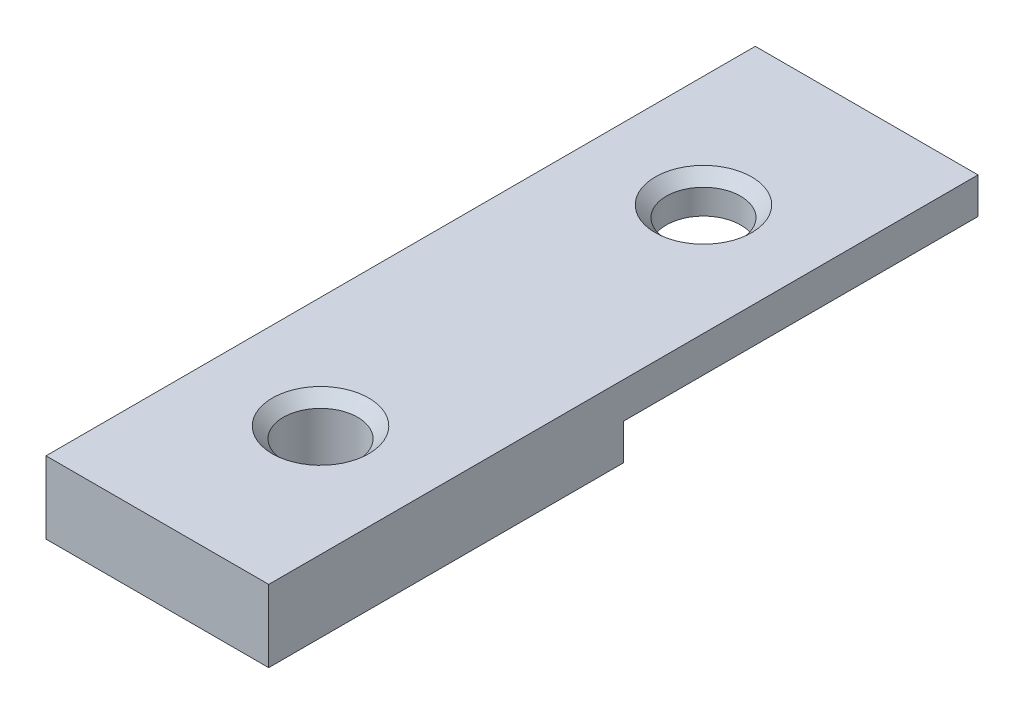
ISO-10303-21;
HEADER;
FILE_DESCRIPTION(('STEP AP214'),'2;1');
FILE_NAME('part.step','',(''),(''),'','','');
FILE_SCHEMA(('AUTOMOTIVE_DESIGN { 1 0 10303 214 1 1 1 1 }'));
ENDSEC;
DATA;
#1=APPLICATION_CONTEXT('core data for automotive mechanical design processes');
#2=APPLICATION_PROTOCOL_DEFINITION('international standard','automotive_design',2000,#1);
#3=PRODUCT_CONTEXT('',#1,'mechanical');
#4=PRODUCT('Part','Part','',(#3));
#5=PRODUCT_RELATED_PRODUCT_CATEGORY('part','',(#4));
#6=PRODUCT_DEFINITION_FORMATION('','',#4);
#7=PRODUCT_DEFINITION_CONTEXT('part definition',#1,'design');
#8=PRODUCT_DEFINITION('design','',#6,#7);
#9=PRODUCT_DEFINITION_SHAPE('','',#8);
#10=(LENGTH_UNIT() NAMED_UNIT(*) SI_UNIT(.MILLI.,.METRE.));
#11=(NAMED_UNIT(*) PLANE_ANGLE_UNIT() SI_UNIT($,.RADIAN.));
#12=(NAMED_UNIT(*) SI_UNIT($,.STERADIAN.) SOLID_ANGLE_UNIT());
#13=UNCERTAINTY_MEASURE_WITH_UNIT(LENGTH_MEASURE(1.E-05),#10,'distance_accuracy_value','');
#14=(GEOMETRIC_REPRESENTATION_CONTEXT(3) GLOBAL_UNCERTAINTY_ASSIGNED_CONTEXT((#13)) GLOBAL_UNIT_ASSIGNED_CONTEXT((#10,
#11,#12)) REPRESENTATION_CONTEXT('',''));
#15=CARTESIAN_POINT('',(0.,0.,0.));
#16=DIRECTION('',(0.,0.,1.));
#17=DIRECTION('',(1.,0.,0.));
#18=AXIS2_PLACEMENT_3D('',#15,#16,#17);
#19=CARTESIAN_POINT('',(-0.55,6.5,0.));
#20=DIRECTION('',(1.,0.,0.));
#21=DIRECTION('',(0.,0.,-1.));
#22=AXIS2_PLACEMENT_3D('',#19,#20,#21);
#23=PLANE('',#22);
#24=DIRECTION('',(0.,-1.,0.));
#25=VECTOR('',#24,1.);
#26=CARTESIAN_POINT('',(-0.549999999999996,0.,32.5));
#27=LINE('',#26,#25);
#28=CARTESIAN_POINT('',(-0.549999999999996,3.25,32.5));
#29=VERTEX_POINT('',#28);
#30=CARTESIAN_POINT('',(-0.549999999999996,0.,32.5));
#31=VERTEX_POINT('',#30);
#32=EDGE_CURVE('E66',#29,#31,#27,.T.);
#33=ORIENTED_EDGE('',*,*,#32,.F.);
#34=DIRECTION('',(0.,0.,1.));
#35=VECTOR('',#34,1.);
#36=CARTESIAN_POINT('',(-0.549999999999996,3.25,32.5));
#37=LINE('',#36,#35);
#38=CARTESIAN_POINT('',(-0.55,3.25,0.55));
#39=VERTEX_POINT('',#38);
#40=EDGE_CURVE('E130',#39,#29,#37,.T.);
#41=ORIENTED_EDGE('',*,*,#40,.F.);
#42=DIRECTION('',(0.,-1.,0.));
#43=VECTOR('',#42,1.);
#44=CARTESIAN_POINT('',(-0.55,6.5,0.55));
#45=LINE('',#44,#43);
#46=CARTESIAN_POINT('',(-0.55,6.5,0.55));
#47=VERTEX_POINT('',#46);
#48=EDGE_CURVE('E97',#47,#39,#45,.T.);
#49=ORIENTED_EDGE('',*,*,#48,.F.);
#50=DIRECTION('',(0.,0.,1.));
#51=VECTOR('',#50,1.);
#52=CARTESIAN_POINT('',(-0.55,6.5,0.));
#53=LINE('',#52,#51);
#54=CARTESIAN_POINT('',(-0.549999999999992,6.5,64.45));
#55=VERTEX_POINT('',#54);
#56=EDGE_CURVE('E147',#47,#55,#53,.T.);
#57=ORIENTED_EDGE('',*,*,#56,.T.);
#58=DIRECTION('',(0.,-1.,0.));
#59=VECTOR('',#58,1.);
#60=CARTESIAN_POINT('',(-0.549999999999992,6.5,64.45));
#61=LINE('',#60,#59);
#62=CARTESIAN_POINT('',(-0.549999999999992,0.,64.45));
#63=VERTEX_POINT('',#62);
#64=EDGE_CURVE('E75',#55,#63,#61,.T.);
#65=ORIENTED_EDGE('',*,*,#64,.T.);
#66=DIRECTION('',(0.,0.,1.));
#67=VECTOR('',#66,1.);
#68=CARTESIAN_POINT('',(-0.55,0.,0.));
#69=LINE('',#68,#67);
#70=EDGE_CURVE('E91',#31,#63,#69,.T.);
#71=ORIENTED_EDGE('',*,*,#70,.F.);
#72=EDGE_LOOP('',(#33,#41,#49,#57,#65,#71));
#73=FACE_BOUND('',#72,.T.);
#74=ADVANCED_FACE('F48',(#73),#23,.T.);
#75=CARTESIAN_POINT('',(0.,6.5,0.55));
#76=DIRECTION('',(0.,0.,1.));
#77=DIRECTION('',(1.,0.,0.));
#78=AXIS2_PLACEMENT_3D('',#75,#76,#77);
#79=PLANE('',#78);
#80=ORIENTED_EDGE('',*,*,#48,.T.);
#81=DIRECTION('',(1.,0.,0.));
#82=VECTOR('',#81,1.);
#83=CARTESIAN_POINT('',(-20.61486665,3.25,0.550000000000003));
#84=LINE('',#83,#82);
#85=CARTESIAN_POINT('',(-20.61486665,3.25,0.550000000000003));
#86=VERTEX_POINT('',#85);
#87=EDGE_CURVE('E120',#86,#39,#84,.T.);
#88=ORIENTED_EDGE('',*,*,#87,.F.);
#89=DIRECTION('',(0.,-1.,0.));
#90=VECTOR('',#89,1.);
#91=CARTESIAN_POINT('',(-20.61486665,6.5,0.550000000000003));
#92=LINE('',#91,#90);
#93=CARTESIAN_POINT('',(-20.61486665,6.5,0.550000000000003));
#94=VERTEX_POINT('',#93);
#95=EDGE_CURVE('E154',#94,#86,#92,.T.);
#96=ORIENTED_EDGE('',*,*,#95,.F.);
#97=DIRECTION('',(-1.,0.,0.));
#98=VECTOR('',#97,1.);
#99=CARTESIAN_POINT('',(0.,6.5,0.55));
#100=LINE('',#99,#98);
#101=EDGE_CURVE('E187',#47,#94,#100,.T.);
#102=ORIENTED_EDGE('',*,*,#101,.F.);
#103=EDGE_LOOP('',(#80,#88,#96,#102));
#104=FACE_BOUND('',#103,.T.);
#105=ADVANCED_FACE('F202',(#104),#79,.F.);
#106=CARTESIAN_POINT('',(-20.61486665,6.5,0.));
#107=DIRECTION('',(1.,0.,0.));
#108=DIRECTION('',(0.,0.,-1.));
#109=AXIS2_PLACEMENT_3D('',#106,#107,#108);
#110=PLANE('',#109);
#111=DIRECTION('',(0.,0.,1.));
#112=VECTOR('',#111,1.);
#113=CARTESIAN_POINT('',(-20.61486665,3.25,32.5));
#114=LINE('',#113,#112);
#115=CARTESIAN_POINT('',(-20.61486665,3.25,32.5));
#116=VERTEX_POINT('',#115);
#117=EDGE_CURVE('E121',#86,#116,#114,.T.);
#118=ORIENTED_EDGE('',*,*,#117,.T.);
#119=DIRECTION('',(0.,-1.,0.));
#120=VECTOR('',#119,1.);
#121=CARTESIAN_POINT('',(-20.61486665,0.,32.5));
#122=LINE('',#121,#120);
#123=CARTESIAN_POINT('',(-20.61486665,0.,32.5));
#124=VERTEX_POINT('',#123);
#125=EDGE_CURVE('E116',#116,#124,#122,.T.);
#126=ORIENTED_EDGE('',*,*,#125,.T.);
#127=DIRECTION('',(0.,0.,1.));
#128=VECTOR('',#127,1.);
#129=CARTESIAN_POINT('',(-20.61486665,0.,0.));
#130=LINE('',#129,#128);
#131=CARTESIAN_POINT('',(-20.61486665,0.,64.45));
#132=VERTEX_POINT('',#131);
#133=EDGE_CURVE('E126',#124,#132,#130,.T.);
#134=ORIENTED_EDGE('',*,*,#133,.T.);
#135=DIRECTION('',(0.,-1.,0.));
#136=VECTOR('',#135,1.);
#137=CARTESIAN_POINT('',(-20.61486665,6.5,64.45));
#138=LINE('',#137,#136);
#139=CARTESIAN_POINT('',(-20.61486665,6.5,64.45));
#140=VERTEX_POINT('',#139);
#141=EDGE_CURVE('E150',#140,#132,#138,.T.);
#142=ORIENTED_EDGE('',*,*,#141,.F.);
#143=DIRECTION('',(0.,0.,1.));
#144=VECTOR('',#143,1.);
#145=CARTESIAN_POINT('',(-20.61486665,6.5,0.));
#146=LINE('',#145,#144);
#147=EDGE_CURVE('E192',#94,#140,#146,.T.);
#148=ORIENTED_EDGE('',*,*,#147,.F.);
#149=ORIENTED_EDGE('',*,*,#95,.T.);
#150=EDGE_LOOP('',(#118,#126,#134,#142,#148,#149));
#151=FACE_BOUND('',#150,.T.);
#152=ADVANCED_FACE('F124',(#151),#110,.F.);
#153=CARTESIAN_POINT('',(-10.582433325,6.5,15.25));
#154=DIRECTION('',(0.,-1.,0.));
#155=DIRECTION('',(0.,0.,-1.));
#156=AXIS2_PLACEMENT_3D('',#153,#154,#155);
#157=CYLINDRICAL_SURFACE('',#156,3.35);
#158=CARTESIAN_POINT('',(-10.582433325,3.25,15.25));
#159=DIRECTION('',(0.,1.,0.));
#160=DIRECTION('',(0.,0.,1.));
#161=AXIS2_PLACEMENT_3D('',#158,#159,#160);
#162=CIRCLE('',#161,3.35);
#163=CARTESIAN_POINT('',(-10.582433325,3.25,18.6));
#164=VERTEX_POINT('',#163);
#165=EDGE_CURVE('E53',#164,#164,#162,.T.);
#166=ORIENTED_EDGE('',*,*,#165,.F.);
#167=EDGE_LOOP('',(#166));
#168=FACE_BOUND('',#167,.T.);
#169=CARTESIAN_POINT('',(-10.582433325,5.49999999999997,15.25));
#170=DIRECTION('',(0.,1.,0.));
#171=DIRECTION('',(0.,0.,1.));
#172=AXIS2_PLACEMENT_3D('',#169,#170,#171);
#173=CIRCLE('',#172,3.35);
#174=CARTESIAN_POINT('',(-10.582433325,5.49999999999997,18.6));
#175=VERTEX_POINT('',#174);
#176=EDGE_CURVE('E11',#175,#175,#173,.T.);
#177=ORIENTED_EDGE('',*,*,#176,.T.);
#178=EDGE_LOOP('',(#177));
#179=FACE_BOUND('',#178,.T.);
#180=ADVANCED_FACE('F231',(#168,#179),#157,.F.);
#181=CARTESIAN_POINT('',(0.,6.5,64.45));
#182=DIRECTION('',(0.,0.,1.));
#183=DIRECTION('',(1.,0.,0.));
#184=AXIS2_PLACEMENT_3D('',#181,#182,#183);
#185=PLANE('',#184);
#186=DIRECTION('',(-1.,0.,0.));
#187=VECTOR('',#186,1.);
#188=CARTESIAN_POINT('',(0.,0.,64.45));
#189=LINE('',#188,#187);
#190=EDGE_CURVE('E134',#63,#132,#189,.T.);
#191=ORIENTED_EDGE('',*,*,#190,.F.);
#192=ORIENTED_EDGE('',*,*,#64,.F.);
#193=DIRECTION('',(-1.,0.,0.));
#194=VECTOR('',#193,1.);
#195=CARTESIAN_POINT('',(0.,6.5,64.45));
#196=LINE('',#195,#194);
#197=EDGE_CURVE('E151',#55,#140,#196,.T.);
#198=ORIENTED_EDGE('',*,*,#197,.T.);
#199=ORIENTED_EDGE('',*,*,#141,.T.);
#200=EDGE_LOOP('',(#191,#192,#198,#199));
#201=FACE_BOUND('',#200,.T.);
#202=ADVANCED_FACE('F198',(#201),#185,.T.);
#203=CARTESIAN_POINT('',(-10.582433325,6.5,49.75));
#204=DIRECTION('',(0.,-1.,0.));
#205=DIRECTION('',(0.,0.,-1.));
#206=AXIS2_PLACEMENT_3D('',#203,#204,#205);
#207=CYLINDRICAL_SURFACE('',#206,3.35);
#208=CARTESIAN_POINT('',(-10.582433325,5.50000000000004,49.75));
#209=DIRECTION('',(0.,1.,0.));
#210=DIRECTION('',(0.,0.,1.));
#211=AXIS2_PLACEMENT_3D('',#208,#209,#210);
#212=CIRCLE('',#211,3.35);
#213=CARTESIAN_POINT('',(-10.582433325,5.50000000000004,53.1));
#214=VERTEX_POINT('',#213);
#215=EDGE_CURVE('E59',#214,#214,#212,.T.);
#216=ORIENTED_EDGE('',*,*,#215,.T.);
#217=EDGE_LOOP('',(#216));
#218=FACE_BOUND('',#217,.T.);
#219=CARTESIAN_POINT('',(-10.582433325,0.,49.75));
#220=DIRECTION('',(0.,1.,0.));
#221=DIRECTION('',(0.,0.,1.));
#222=AXIS2_PLACEMENT_3D('',#219,#220,#221);
#223=CIRCLE('',#222,3.35);
#224=CARTESIAN_POINT('',(-10.582433325,0.,53.1));
#225=VERTEX_POINT('',#224);
#226=EDGE_CURVE('E139',#225,#225,#223,.F.);
#227=ORIENTED_EDGE('',*,*,#226,.T.);
#228=EDGE_LOOP('',(#227));
#229=FACE_BOUND('',#228,.T.);
#230=ADVANCED_FACE('F171',(#218,#229),#207,.F.);
#231=CARTESIAN_POINT('',(0.,6.5,0.));
#232=DIRECTION('',(0.,1.,0.));
#233=DIRECTION('',(0.,0.,1.));
#234=AXIS2_PLACEMENT_3D('',#231,#232,#233);
#235=PLANE('',#234);
#236=CARTESIAN_POINT('',(-10.582433325,6.5,49.75));
#237=DIRECTION('',(0.,1.,0.));
#238=DIRECTION('',(0.,0.,1.));
#239=AXIS2_PLACEMENT_3D('',#236,#237,#238);
#240=CIRCLE('',#239,4.34999999999997);
#241=CARTESIAN_POINT('',(-10.582433325,6.5,54.1));
#242=VERTEX_POINT('',#241);
#243=EDGE_CURVE('E163',#242,#242,#240,.F.);
#244=ORIENTED_EDGE('',*,*,#243,.T.);
#245=EDGE_LOOP('',(#244));
#246=FACE_BOUND('',#245,.T.);
#247=CARTESIAN_POINT('',(-10.582433325,6.5,15.25));
#248=DIRECTION('',(0.,1.,0.));
#249=DIRECTION('',(0.,0.,1.));
#250=AXIS2_PLACEMENT_3D('',#247,#248,#249);
#251=CIRCLE('',#250,4.35000000000003);
#252=CARTESIAN_POINT('',(-10.582433325,6.5,19.6));
#253=VERTEX_POINT('',#252);
#254=EDGE_CURVE('E159',#253,#253,#251,.F.);
#255=ORIENTED_EDGE('',*,*,#254,.T.);
#256=EDGE_LOOP('',(#255));
#257=FACE_BOUND('',#256,.T.);
#258=ORIENTED_EDGE('',*,*,#56,.F.);
#259=ORIENTED_EDGE('',*,*,#101,.T.);
#260=ORIENTED_EDGE('',*,*,#147,.T.);
#261=ORIENTED_EDGE('',*,*,#197,.F.);
#262=EDGE_LOOP('',(#258,#259,#260,#261));
#263=FACE_BOUND('',#262,.T.);
#264=ADVANCED_FACE('F179',(#246,#257,#263),#235,.T.);
#265=CARTESIAN_POINT('',(0.,0.,0.));
#266=DIRECTION('',(0.,1.,0.));
#267=DIRECTION('',(0.,0.,1.));
#268=AXIS2_PLACEMENT_3D('',#265,#266,#267);
#269=PLANE('',#268);
#270=ORIENTED_EDGE('',*,*,#133,.F.);
#271=DIRECTION('',(1.,0.,0.));
#272=VECTOR('',#271,1.);
#273=CARTESIAN_POINT('',(-20.61486665,0.,32.5));
#274=LINE('',#273,#272);
#275=EDGE_CURVE('E113',#124,#31,#274,.T.);
#276=ORIENTED_EDGE('',*,*,#275,.T.);
#277=ORIENTED_EDGE('',*,*,#70,.T.);
#278=ORIENTED_EDGE('',*,*,#190,.T.);
#279=EDGE_LOOP('',(#270,#276,#277,#278));
#280=FACE_BOUND('',#279,.T.);
#281=ORIENTED_EDGE('',*,*,#226,.F.);
#282=EDGE_LOOP('',(#281));
#283=FACE_BOUND('',#282,.T.);
#284=ADVANCED_FACE('F132',(#280,#283),#269,.F.);
#285=CARTESIAN_POINT('',(-10.582433325,6.5,49.75));
#286=DIRECTION('',(0.,1.,0.));
#287=DIRECTION('',(0.,0.,1.));
#288=AXIS2_PLACEMENT_3D('',#285,#286,#287);
#289=CONICAL_SURFACE('',#288,4.34999999999997,0.785398163397449);
#290=ORIENTED_EDGE('',*,*,#215,.F.);
#291=EDGE_LOOP('',(#290));
#292=FACE_BOUND('',#291,.T.);
#293=ORIENTED_EDGE('',*,*,#243,.F.);
#294=EDGE_LOOP('',(#293));
#295=FACE_BOUND('',#294,.T.);
#296=ADVANCED_FACE('F174',(#292,#295),#289,.F.);
#297=CARTESIAN_POINT('',(-10.582433325,5.49999999999997,15.25));
#298=DIRECTION('',(0.,1.,0.));
#299=DIRECTION('',(0.,0.,1.));
#300=AXIS2_PLACEMENT_3D('',#297,#298,#299);
#301=CONICAL_SURFACE('',#300,3.35,0.78539816339745);
#302=ORIENTED_EDGE('',*,*,#254,.F.);
#303=EDGE_LOOP('',(#302));
#304=FACE_BOUND('',#303,.T.);
#305=ORIENTED_EDGE('',*,*,#176,.F.);
#306=EDGE_LOOP('',(#305));
#307=FACE_BOUND('',#306,.T.);
#308=ADVANCED_FACE('F51',(#304,#307),#301,.F.);
#309=CARTESIAN_POINT('',(-20.61486665,0.,32.5));
#310=DIRECTION('',(0.,0.,1.));
#311=DIRECTION('',(1.,0.,0.));
#312=AXIS2_PLACEMENT_3D('',#309,#310,#311);
#313=PLANE('',#312);
#314=ORIENTED_EDGE('',*,*,#32,.T.);
#315=ORIENTED_EDGE('',*,*,#275,.F.);
#316=ORIENTED_EDGE('',*,*,#125,.F.);
#317=DIRECTION('',(1.,0.,0.));
#318=VECTOR('',#317,1.);
#319=CARTESIAN_POINT('',(-20.61486665,3.25,32.5));
#320=LINE('',#319,#318);
#321=EDGE_CURVE('E206',#116,#29,#320,.T.);
#322=ORIENTED_EDGE('',*,*,#321,.T.);
#323=EDGE_LOOP('',(#314,#315,#316,#322));
#324=FACE_BOUND('',#323,.T.);
#325=ADVANCED_FACE('F115',(#324),#313,.F.);
#326=CARTESIAN_POINT('',(-20.61486665,3.25,32.5));
#327=DIRECTION('',(0.,1.,0.));
#328=DIRECTION('',(0.,0.,1.));
#329=AXIS2_PLACEMENT_3D('',#326,#327,#328);
#330=PLANE('',#329);
#331=ORIENTED_EDGE('',*,*,#165,.T.);
#332=EDGE_LOOP('',(#331));
#333=FACE_BOUND('',#332,.T.);
#334=ORIENTED_EDGE('',*,*,#40,.T.);
#335=ORIENTED_EDGE('',*,*,#321,.F.);
#336=ORIENTED_EDGE('',*,*,#117,.F.);
#337=ORIENTED_EDGE('',*,*,#87,.T.);
#338=EDGE_LOOP('',(#334,#335,#336,#337));
#339=FACE_BOUND('',#338,.T.);
#340=ADVANCED_FACE('F215',(#333,#339),#330,.F.);
#341=CLOSED_SHELL('',(#74,#105,#152,#180,#202,#230,#264,#284,#296,#308,#325,#340));
#342=MANIFOLD_SOLID_BREP('B2',#341);
#343=ADVANCED_BREP_SHAPE_REPRESENTATION('',(#18,#342),#14);
#344=SHAPE_DEFINITION_REPRESENTATION(#9,#343);
ENDSEC;
END-ISO-10303-21;
